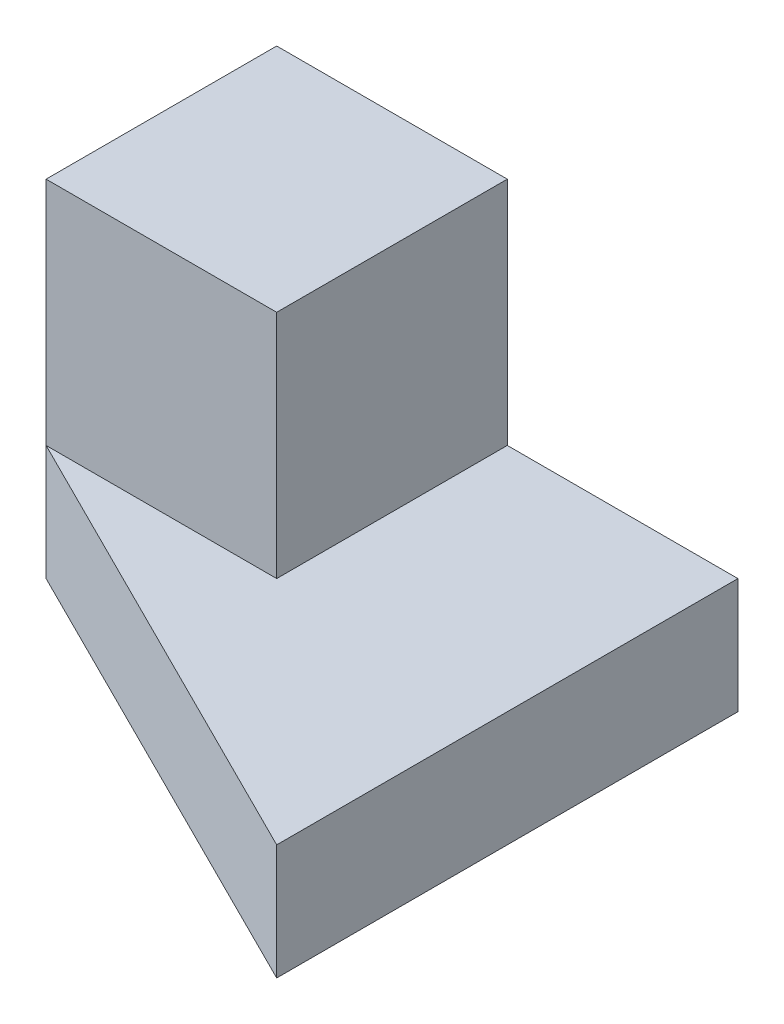
ISO-10303-21;
HEADER;
FILE_DESCRIPTION(('STEP AP214'),'2;1');
FILE_NAME('part.step','',(''),(''),'','','');
FILE_SCHEMA(('AUTOMOTIVE_DESIGN { 1 0 10303 214 1 1 1 1 }'));
ENDSEC;
DATA;
#1=APPLICATION_CONTEXT('core data for automotive mechanical design processes');
#2=APPLICATION_PROTOCOL_DEFINITION('international standard','automotive_design',2000,#1);
#3=PRODUCT_CONTEXT('',#1,'mechanical');
#4=PRODUCT('Part','Part','',(#3));
#5=PRODUCT_RELATED_PRODUCT_CATEGORY('part','',(#4));
#6=PRODUCT_DEFINITION_FORMATION('','',#4);
#7=PRODUCT_DEFINITION_CONTEXT('part definition',#1,'design');
#8=PRODUCT_DEFINITION('design','',#6,#7);
#9=PRODUCT_DEFINITION_SHAPE('','',#8);
#10=(LENGTH_UNIT() NAMED_UNIT(*) SI_UNIT(.MILLI.,.METRE.));
#11=(NAMED_UNIT(*) PLANE_ANGLE_UNIT() SI_UNIT($,.RADIAN.));
#12=(NAMED_UNIT(*) SI_UNIT($,.STERADIAN.) SOLID_ANGLE_UNIT());
#13=UNCERTAINTY_MEASURE_WITH_UNIT(LENGTH_MEASURE(1.E-05),#10,'distance_accuracy_value','');
#14=(GEOMETRIC_REPRESENTATION_CONTEXT(3) GLOBAL_UNCERTAINTY_ASSIGNED_CONTEXT((#13)) GLOBAL_UNIT_ASSIGNED_CONTEXT((#10,
#11,#12)) REPRESENTATION_CONTEXT('',''));
#15=CARTESIAN_POINT('',(0.,0.,0.));
#16=DIRECTION('',(0.,0.,1.));
#17=DIRECTION('',(1.,0.,0.));
#18=AXIS2_PLACEMENT_3D('',#15,#16,#17);
#19=CARTESIAN_POINT('',(0.,15.,0.));
#20=DIRECTION('',(0.,0.,1.));
#21=DIRECTION('',(1.,0.,0.));
#22=AXIS2_PLACEMENT_3D('',#19,#20,#21);
#23=PLANE('',#22);
#24=DIRECTION('',(-1.,0.,0.));
#25=VECTOR('',#24,1.);
#26=CARTESIAN_POINT('',(0.,5.,0.));
#27=LINE('',#26,#25);
#28=CARTESIAN_POINT('',(10.,5.,0.));
#29=VERTEX_POINT('',#28);
#30=CARTESIAN_POINT('',(0.,5.,0.));
#31=VERTEX_POINT('',#30);
#32=EDGE_CURVE('E122',#29,#31,#27,.T.);
#33=ORIENTED_EDGE('',*,*,#32,.F.);
#34=DIRECTION('',(0.,-1.,0.));
#35=VECTOR('',#34,1.);
#36=CARTESIAN_POINT('',(10.,15.,0.));
#37=LINE('',#36,#35);
#38=CARTESIAN_POINT('',(10.,15.,0.));
#39=VERTEX_POINT('',#38);
#40=EDGE_CURVE('E11',#39,#29,#37,.T.);
#41=ORIENTED_EDGE('',*,*,#40,.F.);
#42=DIRECTION('',(-1.,0.,0.));
#43=VECTOR('',#42,1.);
#44=CARTESIAN_POINT('',(0.,15.,0.));
#45=LINE('',#44,#43);
#46=CARTESIAN_POINT('',(0.,15.,0.));
#47=VERTEX_POINT('',#46);
#48=EDGE_CURVE('E103',#39,#47,#45,.T.);
#49=ORIENTED_EDGE('',*,*,#48,.T.);
#50=DIRECTION('',(0.,-1.,0.));
#51=VECTOR('',#50,1.);
#52=CARTESIAN_POINT('',(0.,15.,0.));
#53=LINE('',#52,#51);
#54=EDGE_CURVE('E51',#47,#31,#53,.T.);
#55=ORIENTED_EDGE('',*,*,#54,.T.);
#56=EDGE_LOOP('',(#33,#41,#49,#55));
#57=FACE_BOUND('',#56,.T.);
#58=ADVANCED_FACE('F35',(#57),#23,.T.);
#59=CARTESIAN_POINT('',(10.,15.,0.));
#60=DIRECTION('',(1.,0.,0.));
#61=DIRECTION('',(0.,0.,-1.));
#62=AXIS2_PLACEMENT_3D('',#59,#60,#61);
#63=PLANE('',#62);
#64=DIRECTION('',(0.,0.,1.));
#65=VECTOR('',#64,1.);
#66=CARTESIAN_POINT('',(10.,5.,0.));
#67=LINE('',#66,#65);
#68=CARTESIAN_POINT('',(10.,5.,-10.));
#69=VERTEX_POINT('',#68);
#70=EDGE_CURVE('E94',#69,#29,#67,.T.);
#71=ORIENTED_EDGE('',*,*,#70,.F.);
#72=DIRECTION('',(0.,-1.,0.));
#73=VECTOR('',#72,1.);
#74=CARTESIAN_POINT('',(10.,15.,-10.));
#75=LINE('',#74,#73);
#76=CARTESIAN_POINT('',(10.,15.,-10.));
#77=VERTEX_POINT('',#76);
#78=EDGE_CURVE('E43',#77,#69,#75,.T.);
#79=ORIENTED_EDGE('',*,*,#78,.F.);
#80=DIRECTION('',(0.,0.,1.));
#81=VECTOR('',#80,1.);
#82=CARTESIAN_POINT('',(10.,15.,0.));
#83=LINE('',#82,#81);
#84=EDGE_CURVE('E93',#77,#39,#83,.T.);
#85=ORIENTED_EDGE('',*,*,#84,.T.);
#86=ORIENTED_EDGE('',*,*,#40,.T.);
#87=EDGE_LOOP('',(#71,#79,#85,#86));
#88=FACE_BOUND('',#87,.T.);
#89=ADVANCED_FACE('F92',(#88),#63,.T.);
#90=CARTESIAN_POINT('',(0.,15.,-10.));
#91=DIRECTION('',(0.,0.,-1.));
#92=DIRECTION('',(-1.,0.,0.));
#93=AXIS2_PLACEMENT_3D('',#90,#91,#92);
#94=PLANE('',#93);
#95=DIRECTION('',(1.,0.,0.));
#96=VECTOR('',#95,1.);
#97=CARTESIAN_POINT('',(0.,0.,-10.));
#98=LINE('',#97,#96);
#99=CARTESIAN_POINT('',(0.,0.,-10.));
#100=VERTEX_POINT('',#99);
#101=CARTESIAN_POINT('',(20.,0.,-10.));
#102=VERTEX_POINT('',#101);
#103=EDGE_CURVE('E111',#100,#102,#98,.T.);
#104=ORIENTED_EDGE('',*,*,#103,.F.);
#105=DIRECTION('',(0.,-1.,0.));
#106=VECTOR('',#105,1.);
#107=CARTESIAN_POINT('',(0.,15.,-10.));
#108=LINE('',#107,#106);
#109=CARTESIAN_POINT('',(0.,15.,-10.));
#110=VERTEX_POINT('',#109);
#111=EDGE_CURVE('E61',#110,#100,#108,.T.);
#112=ORIENTED_EDGE('',*,*,#111,.F.);
#113=DIRECTION('',(1.,0.,0.));
#114=VECTOR('',#113,1.);
#115=CARTESIAN_POINT('',(0.,15.,-10.));
#116=LINE('',#115,#114);
#117=EDGE_CURVE('E102',#110,#77,#116,.T.);
#118=ORIENTED_EDGE('',*,*,#117,.T.);
#119=ORIENTED_EDGE('',*,*,#78,.T.);
#120=DIRECTION('',(1.,0.,0.));
#121=VECTOR('',#120,1.);
#122=CARTESIAN_POINT('',(0.,5.,-10.));
#123=LINE('',#122,#121);
#124=CARTESIAN_POINT('',(20.,5.,-10.));
#125=VERTEX_POINT('',#124);
#126=EDGE_CURVE('E72',#69,#125,#123,.T.);
#127=ORIENTED_EDGE('',*,*,#126,.T.);
#128=DIRECTION('',(0.,-1.,0.));
#129=VECTOR('',#128,1.);
#130=CARTESIAN_POINT('',(20.,5.,-10.));
#131=LINE('',#130,#129);
#132=EDGE_CURVE('E142',#125,#102,#131,.T.);
#133=ORIENTED_EDGE('',*,*,#132,.T.);
#134=EDGE_LOOP('',(#104,#112,#118,#119,#127,#133));
#135=FACE_BOUND('',#134,.T.);
#136=ADVANCED_FACE('F105',(#135),#94,.T.);
#137=CARTESIAN_POINT('',(0.,15.,0.));
#138=DIRECTION('',(-1.,0.,0.));
#139=DIRECTION('',(0.,0.,1.));
#140=AXIS2_PLACEMENT_3D('',#137,#138,#139);
#141=PLANE('',#140);
#142=DIRECTION('',(0.,0.,-1.));
#143=VECTOR('',#142,1.);
#144=CARTESIAN_POINT('',(0.,0.,0.));
#145=LINE('',#144,#143);
#146=CARTESIAN_POINT('',(0.,0.,0.));
#147=VERTEX_POINT('',#146);
#148=EDGE_CURVE('E113',#147,#100,#145,.T.);
#149=ORIENTED_EDGE('',*,*,#148,.F.);
#150=DIRECTION('',(0.,-1.,0.));
#151=VECTOR('',#150,1.);
#152=CARTESIAN_POINT('',(0.,5.,0.));
#153=LINE('',#152,#151);
#154=EDGE_CURVE('E114',#31,#147,#153,.T.);
#155=ORIENTED_EDGE('',*,*,#154,.F.);
#156=ORIENTED_EDGE('',*,*,#54,.F.);
#157=DIRECTION('',(0.,0.,-1.));
#158=VECTOR('',#157,1.);
#159=CARTESIAN_POINT('',(0.,15.,0.));
#160=LINE('',#159,#158);
#161=EDGE_CURVE('E106',#47,#110,#160,.T.);
#162=ORIENTED_EDGE('',*,*,#161,.T.);
#163=ORIENTED_EDGE('',*,*,#111,.T.);
#164=EDGE_LOOP('',(#149,#155,#156,#162,#163));
#165=FACE_BOUND('',#164,.T.);
#166=ADVANCED_FACE('F152',(#165),#141,.T.);
#167=CARTESIAN_POINT('',(0.,15.,0.));
#168=DIRECTION('',(0.,1.,0.));
#169=DIRECTION('',(0.,0.,1.));
#170=AXIS2_PLACEMENT_3D('',#167,#168,#169);
#171=PLANE('',#170);
#172=ORIENTED_EDGE('',*,*,#48,.F.);
#173=ORIENTED_EDGE('',*,*,#84,.F.);
#174=ORIENTED_EDGE('',*,*,#117,.F.);
#175=ORIENTED_EDGE('',*,*,#161,.F.);
#176=EDGE_LOOP('',(#172,#173,#174,#175));
#177=FACE_BOUND('',#176,.T.);
#178=ADVANCED_FACE('F100',(#177),#171,.T.);
#179=CARTESIAN_POINT('',(0.,0.,0.));
#180=DIRECTION('',(0.,1.,0.));
#181=DIRECTION('',(0.,0.,1.));
#182=AXIS2_PLACEMENT_3D('',#179,#180,#181);
#183=PLANE('',#182);
#184=ORIENTED_EDGE('',*,*,#103,.T.);
#185=DIRECTION('',(0.,0.,1.));
#186=VECTOR('',#185,1.);
#187=CARTESIAN_POINT('',(20.,0.,0.));
#188=LINE('',#187,#186);
#189=CARTESIAN_POINT('',(20.,0.,10.));
#190=VERTEX_POINT('',#189);
#191=EDGE_CURVE('E129',#102,#190,#188,.T.);
#192=ORIENTED_EDGE('',*,*,#191,.T.);
#193=DIRECTION('',(-0.894427190999916,0.,-0.447213595499958));
#194=VECTOR('',#193,1.);
#195=CARTESIAN_POINT('',(0.,0.,0.));
#196=LINE('',#195,#194);
#197=EDGE_CURVE('E134',#190,#147,#196,.T.);
#198=ORIENTED_EDGE('',*,*,#197,.T.);
#199=ORIENTED_EDGE('',*,*,#148,.T.);
#200=EDGE_LOOP('',(#184,#192,#198,#199));
#201=FACE_BOUND('',#200,.T.);
#202=ADVANCED_FACE('F154',(#201),#183,.F.);
#203=CARTESIAN_POINT('',(0.,5.,0.));
#204=DIRECTION('',(-0.447213595499958,0.,0.894427190999916));
#205=DIRECTION('',(0.894427190999916,0.,0.447213595499958));
#206=AXIS2_PLACEMENT_3D('',#203,#204,#205);
#207=PLANE('',#206);
#208=ORIENTED_EDGE('',*,*,#197,.F.);
#209=DIRECTION('',(0.,-1.,0.));
#210=VECTOR('',#209,1.);
#211=CARTESIAN_POINT('',(20.,5.,10.));
#212=LINE('',#211,#210);
#213=CARTESIAN_POINT('',(20.,5.,10.));
#214=VERTEX_POINT('',#213);
#215=EDGE_CURVE('E146',#214,#190,#212,.T.);
#216=ORIENTED_EDGE('',*,*,#215,.F.);
#217=DIRECTION('',(-0.894427190999916,0.,-0.447213595499958));
#218=VECTOR('',#217,1.);
#219=CARTESIAN_POINT('',(0.,5.,0.));
#220=LINE('',#219,#218);
#221=EDGE_CURVE('E131',#214,#31,#220,.T.);
#222=ORIENTED_EDGE('',*,*,#221,.T.);
#223=ORIENTED_EDGE('',*,*,#154,.T.);
#224=EDGE_LOOP('',(#208,#216,#222,#223));
#225=FACE_BOUND('',#224,.T.);
#226=ADVANCED_FACE('F151',(#225),#207,.T.);
#227=CARTESIAN_POINT('',(20.,5.,0.));
#228=DIRECTION('',(1.,0.,0.));
#229=DIRECTION('',(0.,0.,-1.));
#230=AXIS2_PLACEMENT_3D('',#227,#228,#229);
#231=PLANE('',#230);
#232=ORIENTED_EDGE('',*,*,#191,.F.);
#233=ORIENTED_EDGE('',*,*,#132,.F.);
#234=DIRECTION('',(0.,0.,1.));
#235=VECTOR('',#234,1.);
#236=CARTESIAN_POINT('',(20.,5.,0.));
#237=LINE('',#236,#235);
#238=EDGE_CURVE('E138',#125,#214,#237,.T.);
#239=ORIENTED_EDGE('',*,*,#238,.T.);
#240=ORIENTED_EDGE('',*,*,#215,.T.);
#241=EDGE_LOOP('',(#232,#233,#239,#240));
#242=FACE_BOUND('',#241,.T.);
#243=ADVANCED_FACE('F157',(#242),#231,.T.);
#244=CARTESIAN_POINT('',(0.,5.,0.));
#245=DIRECTION('',(0.,1.,0.));
#246=DIRECTION('',(0.,0.,1.));
#247=AXIS2_PLACEMENT_3D('',#244,#245,#246);
#248=PLANE('',#247);
#249=ORIENTED_EDGE('',*,*,#70,.T.);
#250=ORIENTED_EDGE('',*,*,#32,.T.);
#251=ORIENTED_EDGE('',*,*,#221,.F.);
#252=ORIENTED_EDGE('',*,*,#238,.F.);
#253=ORIENTED_EDGE('',*,*,#126,.F.);
#254=EDGE_LOOP('',(#249,#250,#251,#252,#253));
#255=FACE_BOUND('',#254,.T.);
#256=ADVANCED_FACE('F128',(#255),#248,.T.);
#257=CLOSED_SHELL('',(#58,#89,#136,#166,#178,#202,#226,#243,#256));
#258=MANIFOLD_SOLID_BREP('B2',#257);
#259=ADVANCED_BREP_SHAPE_REPRESENTATION('',(#18,#258),#14);
#260=SHAPE_DEFINITION_REPRESENTATION(#9,#259);
ENDSEC;
END-ISO-10303-21;
